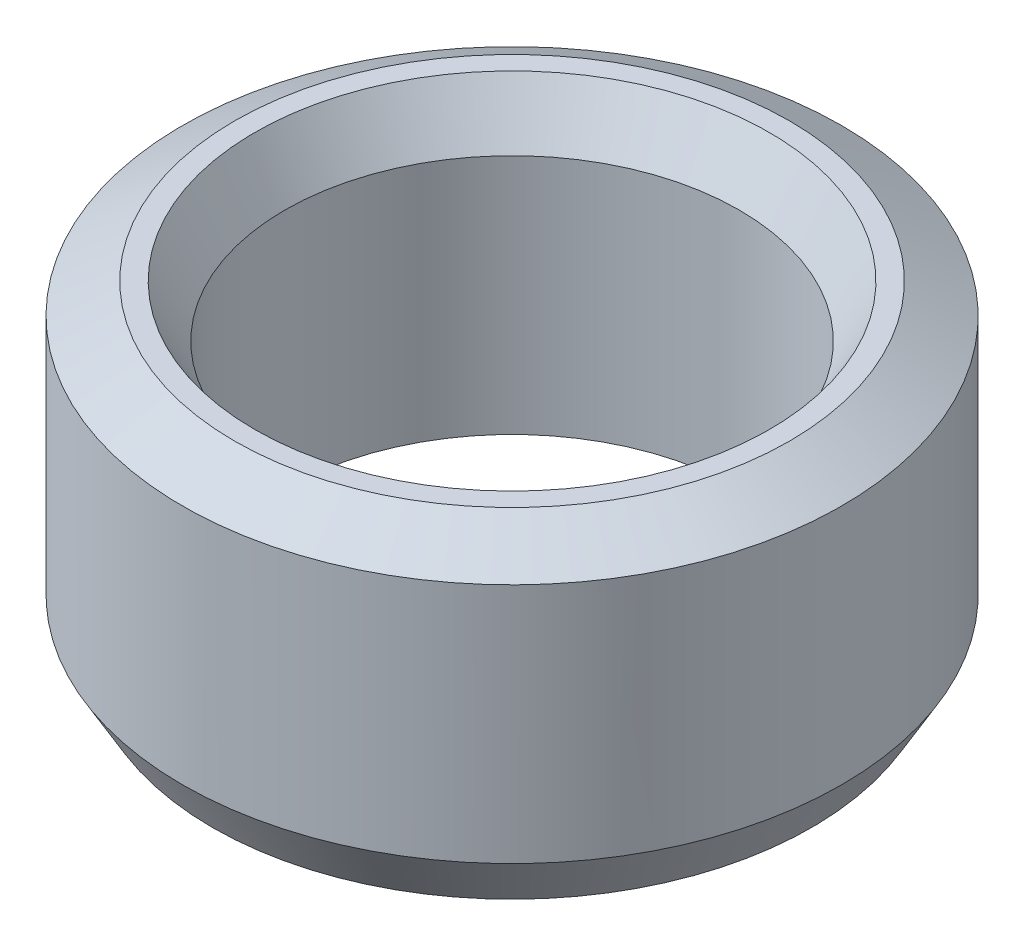
ISO-10303-21;
HEADER;
FILE_DESCRIPTION(('STEP AP214'),'2;1');
FILE_NAME('part.step','',(''),(''),'','','');
FILE_SCHEMA(('AUTOMOTIVE_DESIGN { 1 0 10303 214 1 1 1 1 }'));
ENDSEC;
DATA;
#1=APPLICATION_CONTEXT('core data for automotive mechanical design processes');
#2=APPLICATION_PROTOCOL_DEFINITION('international standard','automotive_design',2000,#1);
#3=PRODUCT_CONTEXT('',#1,'mechanical');
#4=PRODUCT('Part','Part','',(#3));
#5=PRODUCT_RELATED_PRODUCT_CATEGORY('part','',(#4));
#6=PRODUCT_DEFINITION_FORMATION('','',#4);
#7=PRODUCT_DEFINITION_CONTEXT('part definition',#1,'design');
#8=PRODUCT_DEFINITION('design','',#6,#7);
#9=PRODUCT_DEFINITION_SHAPE('','',#8);
#10=(LENGTH_UNIT() NAMED_UNIT(*) SI_UNIT(.MILLI.,.METRE.));
#11=(NAMED_UNIT(*) PLANE_ANGLE_UNIT() SI_UNIT($,.RADIAN.));
#12=(NAMED_UNIT(*) SI_UNIT($,.STERADIAN.) SOLID_ANGLE_UNIT());
#13=UNCERTAINTY_MEASURE_WITH_UNIT(LENGTH_MEASURE(1.E-05),#10,'distance_accuracy_value','');
#14=(GEOMETRIC_REPRESENTATION_CONTEXT(3) GLOBAL_UNCERTAINTY_ASSIGNED_CONTEXT((#13)) GLOBAL_UNIT_ASSIGNED_CONTEXT((#10,
#11,#12)) REPRESENTATION_CONTEXT('',''));
#15=CARTESIAN_POINT('',(0.,0.,0.));
#16=DIRECTION('',(0.,0.,1.));
#17=DIRECTION('',(1.,0.,0.));
#18=AXIS2_PLACEMENT_3D('',#15,#16,#17);
#19=CARTESIAN_POINT('',(0.,7.36584802946749,0.));
#20=DIRECTION('',(0.,-1.,0.));
#21=DIRECTION('',(0.,0.,-1.));
#22=AXIS2_PLACEMENT_3D('',#19,#20,#21);
#23=CYLINDRICAL_SURFACE('',#22,7.5);
#24=CARTESIAN_POINT('',(0.,1.18661255183561,0.));
#25=DIRECTION('',(0.,1.,0.));
#26=DIRECTION('',(0.,0.,1.));
#27=AXIS2_PLACEMENT_3D('',#24,#25,#26);
#28=CIRCLE('',#27,7.5);
#29=CARTESIAN_POINT('',(0.,1.18661255183561,-7.5));
#30=VERTEX_POINT('',#29);
#31=EDGE_CURVE('E10',#30,#30,#28,.T.);
#32=CARTESIAN_POINT('',(0.,6.68075695324142,0.));
#33=DIRECTION('',(0.,1.,0.));
#34=DIRECTION('',(0.,0.,1.));
#35=AXIS2_PLACEMENT_3D('',#32,#33,#34);
#36=CIRCLE('',#35,7.5);
#37=CARTESIAN_POINT('',(0.,6.68075695324142,-7.5));
#38=VERTEX_POINT('',#37);
#39=EDGE_CURVE('E50',#38,#38,#36,.F.);
#40=CARTESIAN_POINT('',(0.,1.18661255183561,-7.5));
#41=CARTESIAN_POINT('',(0.,1.24384322268359,-7.5));
#42=CARTESIAN_POINT('',(0.,1.30107389353157,-7.5));
#43=CARTESIAN_POINT('',(0.,1.41553523522752,-7.5));
#44=CARTESIAN_POINT('',(0.,1.4727659060755,-7.5));
#45=CARTESIAN_POINT('',(0.,1.58722724777145,-7.5));
#46=CARTESIAN_POINT('',(0.,1.64445791861943,-7.5));
#47=CARTESIAN_POINT('',(0.,1.75891926031539,-7.5));
#48=CARTESIAN_POINT('',(0.,1.81614993116336,-7.5));
#49=CARTESIAN_POINT('',(0.,1.93061127285932,-7.5));
#50=CARTESIAN_POINT('',(0.,1.98784194370729,-7.5));
#51=CARTESIAN_POINT('',(0.,2.10230328540325,-7.5));
#52=CARTESIAN_POINT('',(0.,2.15953395625123,-7.5));
#53=CARTESIAN_POINT('',(0.,2.27399529794718,-7.5));
#54=CARTESIAN_POINT('',(0.,2.33122596879516,-7.5));
#55=CARTESIAN_POINT('',(0.,2.44568731049111,-7.5));
#56=CARTESIAN_POINT('',(0.,2.50291798133909,-7.5));
#57=CARTESIAN_POINT('',(0.,2.61737932303504,-7.5));
#58=CARTESIAN_POINT('',(0.,2.67460999388302,-7.5));
#59=CARTESIAN_POINT('',(0.,2.78907133557898,-7.5));
#60=CARTESIAN_POINT('',(0.,2.84630200642695,-7.5));
#61=CARTESIAN_POINT('',(0.,2.96076334812291,-7.5));
#62=CARTESIAN_POINT('',(0.,3.01799401897088,-7.5));
#63=CARTESIAN_POINT('',(0.,3.13245536066684,-7.5));
#64=CARTESIAN_POINT('',(0.,3.18968603151482,-7.5));
#65=CARTESIAN_POINT('',(0.,3.30414737321077,-7.5));
#66=CARTESIAN_POINT('',(0.,3.36137804405875,-7.5));
#67=CARTESIAN_POINT('',(0.,3.4758393857547,-7.5));
#68=CARTESIAN_POINT('',(0.,3.53307005660268,-7.5));
#69=CARTESIAN_POINT('',(0.,3.64753139829863,-7.5));
#70=CARTESIAN_POINT('',(0.,3.70476206914661,-7.5));
#71=CARTESIAN_POINT('',(0.,3.81922341084256,-7.5));
#72=CARTESIAN_POINT('',(0.,3.87645408169054,-7.5));
#73=CARTESIAN_POINT('',(0.,3.9909154233865,-7.5));
#74=CARTESIAN_POINT('',(0.,4.04814609423447,-7.5));
#75=CARTESIAN_POINT('',(0.,4.16260743593043,-7.5));
#76=CARTESIAN_POINT('',(0.,4.2198381067784,-7.5));
#77=CARTESIAN_POINT('',(0.,4.33429944847436,-7.5));
#78=CARTESIAN_POINT('',(0.,4.39153011932234,-7.5));
#79=CARTESIAN_POINT('',(0.,4.50599146101829,-7.5));
#80=CARTESIAN_POINT('',(0.,4.56322213186627,-7.5));
#81=CARTESIAN_POINT('',(0.,4.67768347356222,-7.5));
#82=CARTESIAN_POINT('',(0.,4.7349141444102,-7.5));
#83=CARTESIAN_POINT('',(0.,4.84937548610615,-7.5));
#84=CARTESIAN_POINT('',(0.,4.90660615695413,-7.5));
#85=CARTESIAN_POINT('',(0.,5.02106749865009,-7.5));
#86=CARTESIAN_POINT('',(0.,5.07829816949806,-7.5));
#87=CARTESIAN_POINT('',(0.,5.19275951119402,-7.5));
#88=CARTESIAN_POINT('',(0.,5.24999018204199,-7.5));
#89=CARTESIAN_POINT('',(0.,5.36445152373795,-7.5));
#90=CARTESIAN_POINT('',(0.,5.42168219458592,-7.5));
#91=CARTESIAN_POINT('',(0.,5.53614353628188,-7.5));
#92=CARTESIAN_POINT('',(0.,5.59337420712986,-7.5));
#93=CARTESIAN_POINT('',(0.,5.70783554882581,-7.5));
#94=CARTESIAN_POINT('',(0.,5.76506621967379,-7.5));
#95=CARTESIAN_POINT('',(0.,5.87952756136974,-7.5));
#96=CARTESIAN_POINT('',(0.,5.93675823221772,-7.5));
#97=CARTESIAN_POINT('',(0.,6.05121957391367,-7.5));
#98=CARTESIAN_POINT('',(0.,6.10845024476165,-7.5));
#99=CARTESIAN_POINT('',(0.,6.22291158645761,-7.5));
#100=CARTESIAN_POINT('',(0.,6.28014225730558,-7.5));
#101=CARTESIAN_POINT('',(0.,6.39460359900154,-7.5));
#102=CARTESIAN_POINT('',(0.,6.45183426984952,-7.5));
#103=CARTESIAN_POINT('',(0.,6.56629561154547,-7.5));
#104=CARTESIAN_POINT('',(0.,6.62352628239345,-7.5));
#105=CARTESIAN_POINT('',(0.,6.68075695324142,-7.5));
#106=B_SPLINE_CURVE_WITH_KNOTS('',3,(#40,#41,#42,#43,#44,#45,#46,#47,#48,#49,#50,#51,#52,#53,
#54,#55,#56,#57,#58,#59,#60,#61,#62,#63,#64,#65,#66,#67,#68,#69,#70,#71,#72,#73,#74,#75,#76,#77,
#78,#79,#80,#81,#82,#83,#84,#85,#86,#87,#88,#89,#90,#91,#92,#93,#94,#95,#96,#97,#98,#99,#100,
#101,#102,#103,#104,#105),.UNSPECIFIED.,.F.,.F.,(4,2,2,2,2,2,2,2,2,2,2,2,2,2,2,2,2,2,2,2,2,2,2,
2,2,2,2,2,2,2,2,2,4),(0.,0.171692012543931,0.343384025087863,0.515076037631795,
0.686768050175726,0.858460062719658,1.03015207526359,1.20184408780752,1.37353610035145,
1.54522811289538,1.71692012543932,1.88861213798325,2.06030415052718,2.23199616307111,
2.40368817561504,2.57538018815897,2.74707220070291,2.91876421324684,3.09045622579077,
3.2621482383347,3.43384025087863,3.60553226342256,3.77722427596649,3.94891628851043,
4.12060830105436,4.29230031359829,4.46399232614222,4.63568433868615,4.80737635123008,
4.97906836377402,5.15076037631795,5.32245238886188,5.49414440140581),.UNSPECIFIED.);
#107=EDGE_CURVE('BSEAM39',#30,#38,#106,.T.);
#108=ORIENTED_EDGE('',*,*,#31,.T.);
#109=ORIENTED_EDGE('',*,*,#39,.T.);
#110=ORIENTED_EDGE('',*,*,#107,.T.);
#111=ORIENTED_EDGE('',*,*,#107,.F.);
#112=EDGE_LOOP('',(#108,#110,#109,#111));
#113=FACE_BOUND('',#112,.T.);
#114=ADVANCED_FACE('F39',(#113),#23,.T.);
#115=CARTESIAN_POINT('',(0.,7.36584802946749,0.));
#116=DIRECTION('',(0.,1.,0.));
#117=DIRECTION('',(0.,0.,1.));
#118=AXIS2_PLACEMENT_3D('',#115,#116,#117);
#119=PLANE('',#118);
#120=CARTESIAN_POINT('',(0.,7.36584802946749,0.));
#121=DIRECTION('',(0.,1.,0.));
#122=DIRECTION('',(0.,0.,1.));
#123=AXIS2_PLACEMENT_3D('',#120,#121,#122);
#124=CIRCLE('',#123,5.85567169773917);
#125=CARTESIAN_POINT('',(0.,7.36584802946749,5.85567169773917));
#126=VERTEX_POINT('',#125);
#127=EDGE_CURVE('E58',#126,#126,#124,.F.);
#128=ORIENTED_EDGE('',*,*,#127,.T.);
#129=EDGE_LOOP('',(#128));
#130=FACE_BOUND('',#129,.T.);
#131=CARTESIAN_POINT('',(0.,7.36584802946749,0.));
#132=DIRECTION('',(0.,1.,0.));
#133=DIRECTION('',(0.,0.,1.));
#134=AXIS2_PLACEMENT_3D('',#131,#132,#133);
#135=CIRCLE('',#134,6.31338744816442);
#136=CARTESIAN_POINT('',(0.,7.36584802946749,6.31338744816442));
#137=VERTEX_POINT('',#136);
#138=EDGE_CURVE('E61',#137,#137,#135,.T.);
#139=ORIENTED_EDGE('',*,*,#138,.T.);
#140=EDGE_LOOP('',(#139));
#141=FACE_BOUND('',#140,.T.);
#142=ADVANCED_FACE('F88',(#130,#141),#119,.T.);
#143=CARTESIAN_POINT('',(0.,0.,0.));
#144=DIRECTION('',(0.,1.,0.));
#145=DIRECTION('',(0.,0.,1.));
#146=AXIS2_PLACEMENT_3D('',#143,#144,#145);
#147=PLANE('',#146);
#148=CARTESIAN_POINT('',(0.,0.,0.));
#149=DIRECTION('',(0.,1.,0.));
#150=DIRECTION('',(0.,0.,1.));
#151=AXIS2_PLACEMENT_3D('',#148,#149,#150);
#152=CIRCLE('',#151,6.35719317334866);
#153=CARTESIAN_POINT('',(0.,0.,6.35719317334866));
#154=VERTEX_POINT('',#153);
#155=EDGE_CURVE('E51',#154,#154,#152,.T.);
#156=ORIENTED_EDGE('',*,*,#155,.T.);
#157=EDGE_LOOP('',(#156));
#158=FACE_BOUND('',#157,.T.);
#159=CARTESIAN_POINT('',(0.,0.,0.));
#160=DIRECTION('',(0.,1.,0.));
#161=DIRECTION('',(0.,0.,1.));
#162=AXIS2_PLACEMENT_3D('',#159,#160,#161);
#163=CIRCLE('',#162,6.81490892377391);
#164=CARTESIAN_POINT('',(0.,0.,6.81490892377391));
#165=VERTEX_POINT('',#164);
#166=EDGE_CURVE('E54',#165,#165,#163,.F.);
#167=ORIENTED_EDGE('',*,*,#166,.T.);
#168=EDGE_LOOP('',(#167));
#169=FACE_BOUND('',#168,.T.);
#170=ADVANCED_FACE('F83',(#158,#169),#147,.F.);
#171=CARTESIAN_POINT('',(0.,7.36584802946749,0.));
#172=DIRECTION('',(0.,-1.,0.));
#173=DIRECTION('',(0.,0.,-1.));
#174=AXIS2_PLACEMENT_3D('',#171,#172,#173);
#175=CYLINDRICAL_SURFACE('',#174,5.17058062151308);
#176=CARTESIAN_POINT('',(0.,6.17923547763187,0.));
#177=DIRECTION('',(0.,1.,0.));
#178=DIRECTION('',(0.,0.,1.));
#179=AXIS2_PLACEMENT_3D('',#176,#177,#178);
#180=CIRCLE('',#179,5.17058062151308);
#181=CARTESIAN_POINT('',(0.,6.17923547763187,-5.17058062151308));
#182=VERTEX_POINT('',#181);
#183=EDGE_CURVE('E67',#182,#182,#180,.T.);
#184=CARTESIAN_POINT('',(0.,0.685091076226066,0.));
#185=DIRECTION('',(0.,1.,0.));
#186=DIRECTION('',(0.,0.,1.));
#187=AXIS2_PLACEMENT_3D('',#184,#185,#186);
#188=CIRCLE('',#187,5.17058062151308);
#189=CARTESIAN_POINT('',(0.,0.685091076226066,-5.17058062151308));
#190=VERTEX_POINT('',#189);
#191=EDGE_CURVE('E69',#190,#190,#188,.F.);
#192=CARTESIAN_POINT('',(0.,6.17923547763187,-5.17058062151308));
#193=CARTESIAN_POINT('',(0.,6.12200480678389,-5.17058062151308));
#194=CARTESIAN_POINT('',(0.,6.06477413593591,-5.17058062151308));
#195=CARTESIAN_POINT('',(0.,5.95031279423996,-5.17058062151308));
#196=CARTESIAN_POINT('',(0.,5.89308212339198,-5.17058062151308));
#197=CARTESIAN_POINT('',(0.,5.77862078169603,-5.17058062151308));
#198=CARTESIAN_POINT('',(0.,5.72139011084805,-5.17058062151308));
#199=CARTESIAN_POINT('',(0.,5.6069287691521,-5.17058062151308));
#200=CARTESIAN_POINT('',(0.,5.54969809830412,-5.17058062151308));
#201=CARTESIAN_POINT('',(0.,5.43523675660817,-5.17058062151308));
#202=CARTESIAN_POINT('',(0.,5.37800608576019,-5.17058062151308));
#203=CARTESIAN_POINT('',(0.,5.26354474406423,-5.17058062151308));
#204=CARTESIAN_POINT('',(0.,5.20631407321626,-5.17058062151308));
#205=CARTESIAN_POINT('',(0.,5.0918527315203,-5.17058062151308));
#206=CARTESIAN_POINT('',(0.,5.03462206067233,-5.17058062151308));
#207=CARTESIAN_POINT('',(0.,4.92016071897637,-5.17058062151308));
#208=CARTESIAN_POINT('',(0.,4.8629300481284,-5.17058062151308));
#209=CARTESIAN_POINT('',(0.,4.74846870643244,-5.17058062151308));
#210=CARTESIAN_POINT('',(0.,4.69123803558446,-5.17058062151308));
#211=CARTESIAN_POINT('',(0.,4.57677669388851,-5.17058062151308));
#212=CARTESIAN_POINT('',(0.,4.51954602304053,-5.17058062151308));
#213=CARTESIAN_POINT('',(0.,4.40508468134458,-5.17058062151308));
#214=CARTESIAN_POINT('',(0.,4.3478540104966,-5.17058062151308));
#215=CARTESIAN_POINT('',(0.,4.23339266880065,-5.17058062151308));
#216=CARTESIAN_POINT('',(0.,4.17616199795267,-5.17058062151308));
#217=CARTESIAN_POINT('',(0.,4.06170065625672,-5.17058062151308));
#218=CARTESIAN_POINT('',(0.,4.00446998540874,-5.17058062151308));
#219=CARTESIAN_POINT('',(0.,3.89000864371278,-5.17058062151308));
#220=CARTESIAN_POINT('',(0.,3.83277797286481,-5.17058062151308));
#221=CARTESIAN_POINT('',(0.,3.71831663116885,-5.17058062151308));
#222=CARTESIAN_POINT('',(0.,3.66108596032088,-5.17058062151308));
#223=CARTESIAN_POINT('',(0.,3.54662461862492,-5.17058062151308));
#224=CARTESIAN_POINT('',(0.,3.48939394777694,-5.17058062151308));
#225=CARTESIAN_POINT('',(0.,3.37493260608099,-5.17058062151308));
#226=CARTESIAN_POINT('',(0.,3.31770193523301,-5.17058062151308));
#227=CARTESIAN_POINT('',(0.,3.20324059353706,-5.17058062151308));
#228=CARTESIAN_POINT('',(0.,3.14600992268908,-5.17058062151308));
#229=CARTESIAN_POINT('',(0.,3.03154858099313,-5.17058062151308));
#230=CARTESIAN_POINT('',(0.,2.97431791014515,-5.17058062151308));
#231=CARTESIAN_POINT('',(0.,2.8598565684492,-5.17058062151308));
#232=CARTESIAN_POINT('',(0.,2.80262589760122,-5.17058062151308));
#233=CARTESIAN_POINT('',(0.,2.68816455590526,-5.17058062151308));
#234=CARTESIAN_POINT('',(0.,2.63093388505729,-5.17058062151308));
#235=CARTESIAN_POINT('',(0.,2.51647254336133,-5.17058062151308));
#236=CARTESIAN_POINT('',(0.,2.45924187251336,-5.17058062151308));
#237=CARTESIAN_POINT('',(0.,2.3447805308174,-5.17058062151308));
#238=CARTESIAN_POINT('',(0.,2.28754985996942,-5.17058062151308));
#239=CARTESIAN_POINT('',(0.,2.17308851827347,-5.17058062151308));
#240=CARTESIAN_POINT('',(0.,2.11585784742549,-5.17058062151308));
#241=CARTESIAN_POINT('',(0.,2.00139650572954,-5.17058062151308));
#242=CARTESIAN_POINT('',(0.,1.94416583488156,-5.17058062151308));
#243=CARTESIAN_POINT('',(0.,1.82970449318561,-5.17058062151308));
#244=CARTESIAN_POINT('',(0.,1.77247382233763,-5.17058062151308));
#245=CARTESIAN_POINT('',(0.,1.65801248064168,-5.17058062151308));
#246=CARTESIAN_POINT('',(0.,1.6007818097937,-5.17058062151308));
#247=CARTESIAN_POINT('',(0.,1.48632046809775,-5.17058062151308));
#248=CARTESIAN_POINT('',(0.,1.42908979724977,-5.17058062151308));
#249=CARTESIAN_POINT('',(0.,1.31462845555381,-5.17058062151308));
#250=CARTESIAN_POINT('',(0.,1.25739778470584,-5.17058062151308));
#251=CARTESIAN_POINT('',(0.,1.14293644300988,-5.17058062151308));
#252=CARTESIAN_POINT('',(0.,1.08570577216191,-5.17058062151308));
#253=CARTESIAN_POINT('',(0.,0.971244430465951,-5.17058062151308));
#254=CARTESIAN_POINT('',(0.,0.914013759617974,-5.17058062151308));
#255=CARTESIAN_POINT('',(0.,0.799552417922019,-5.17058062151308));
#256=CARTESIAN_POINT('',(0.,0.742321747074043,-5.17058062151308));
#257=CARTESIAN_POINT('',(0.,0.685091076226066,-5.17058062151308));
#258=B_SPLINE_CURVE_WITH_KNOTS('',3,(#192,#193,#194,#195,#196,#197,#198,#199,#200,#201,#202,
#203,#204,#205,#206,#207,#208,#209,#210,#211,#212,#213,#214,#215,#216,#217,#218,#219,#220,#221,
#222,#223,#224,#225,#226,#227,#228,#229,#230,#231,#232,#233,#234,#235,#236,#237,#238,#239,#240,
#241,#242,#243,#244,#245,#246,#247,#248,#249,#250,#251,#252,#253,#254,#255,#256,#257),
.UNSPECIFIED.,.F.,.F.,(4,2,2,2,2,2,2,2,2,2,2,2,2,2,2,2,2,2,2,2,2,2,2,2,2,2,2,2,2,2,2,2,4),(0.,
0.171692012543931,0.343384025087863,0.515076037631794,0.686768050175726,0.858460062719657,
1.03015207526359,1.20184408780752,1.37353610035145,1.54522811289538,1.71692012543931,
1.88861213798325,2.06030415052718,2.23199616307111,2.40368817561504,2.57538018815897,
2.7470722007029,2.91876421324683,3.09045622579076,3.2621482383347,3.43384025087863,
3.60553226342256,3.77722427596649,3.94891628851042,4.12060830105435,4.29230031359828,
4.46399232614221,4.63568433868615,4.80737635123008,4.97906836377401,5.15076037631794,
5.32245238886187,5.4941444014058),.UNSPECIFIED.);
#259=EDGE_CURVE('BSEAM71',#182,#190,#258,.T.);
#260=ORIENTED_EDGE('',*,*,#183,.T.);
#261=ORIENTED_EDGE('',*,*,#191,.T.);
#262=ORIENTED_EDGE('',*,*,#259,.T.);
#263=ORIENTED_EDGE('',*,*,#259,.F.);
#264=EDGE_LOOP('',(#260,#262,#261,#263));
#265=FACE_BOUND('',#264,.T.);
#266=ADVANCED_FACE('F71',(#265),#175,.F.);
#267=CARTESIAN_POINT('',(0.,6.17923547763187,0.));
#268=DIRECTION('',(0.,1.,0.));
#269=DIRECTION('',(0.,0.,1.));
#270=AXIS2_PLACEMENT_3D('',#267,#268,#269);
#271=CONICAL_SURFACE('',#270,5.17058062151308,0.523598775598302);
#272=ORIENTED_EDGE('',*,*,#127,.F.);
#273=EDGE_LOOP('',(#272));
#274=FACE_BOUND('',#273,.T.);
#275=ORIENTED_EDGE('',*,*,#183,.F.);
#276=EDGE_LOOP('',(#275));
#277=FACE_BOUND('',#276,.T.);
#278=ADVANCED_FACE('F77',(#274,#277),#271,.F.);
#279=CARTESIAN_POINT('',(0.,0.,0.));
#280=DIRECTION('',(0.,-1.,0.));
#281=DIRECTION('',(0.,0.,-1.));
#282=AXIS2_PLACEMENT_3D('',#279,#280,#281);
#283=CONICAL_SURFACE('',#282,6.35719317334866,1.04719755119659);
#284=ORIENTED_EDGE('',*,*,#191,.F.);
#285=EDGE_LOOP('',(#284));
#286=FACE_BOUND('',#285,.T.);
#287=ORIENTED_EDGE('',*,*,#155,.F.);
#288=EDGE_LOOP('',(#287));
#289=FACE_BOUND('',#288,.T.);
#290=ADVANCED_FACE('F73',(#286,#289),#283,.F.);
#291=CARTESIAN_POINT('',(0.,1.18661255183561,0.));
#292=DIRECTION('',(0.,1.,0.));
#293=DIRECTION('',(0.,0.,1.));
#294=AXIS2_PLACEMENT_3D('',#291,#292,#293);
#295=CONICAL_SURFACE('',#294,7.5,0.523598775598303);
#296=ORIENTED_EDGE('',*,*,#166,.F.);
#297=EDGE_LOOP('',(#296));
#298=FACE_BOUND('',#297,.T.);
#299=ORIENTED_EDGE('',*,*,#31,.F.);
#300=EDGE_LOOP('',(#299));
#301=FACE_BOUND('',#300,.T.);
#302=ADVANCED_FACE('F76',(#298,#301),#295,.T.);
#303=CARTESIAN_POINT('',(0.,7.36584802946749,0.));
#304=DIRECTION('',(0.,-1.,0.));
#305=DIRECTION('',(0.,0.,-1.));
#306=AXIS2_PLACEMENT_3D('',#303,#304,#305);
#307=CONICAL_SURFACE('',#306,6.31338744816442,1.0471975511966);
#308=ORIENTED_EDGE('',*,*,#39,.F.);
#309=EDGE_LOOP('',(#308));
#310=FACE_BOUND('',#309,.T.);
#311=ORIENTED_EDGE('',*,*,#138,.F.);
#312=EDGE_LOOP('',(#311));
#313=FACE_BOUND('',#312,.T.);
#314=ADVANCED_FACE('F45',(#310,#313),#307,.T.);
#315=CLOSED_SHELL('',(#114,#142,#170,#266,#278,#290,#302,#314));
#316=MANIFOLD_SOLID_BREP('B2',#315);
#317=ADVANCED_BREP_SHAPE_REPRESENTATION('',(#18,#316),#14);
#318=SHAPE_DEFINITION_REPRESENTATION(#9,#317);
ENDSEC;
END-ISO-10303-21;
